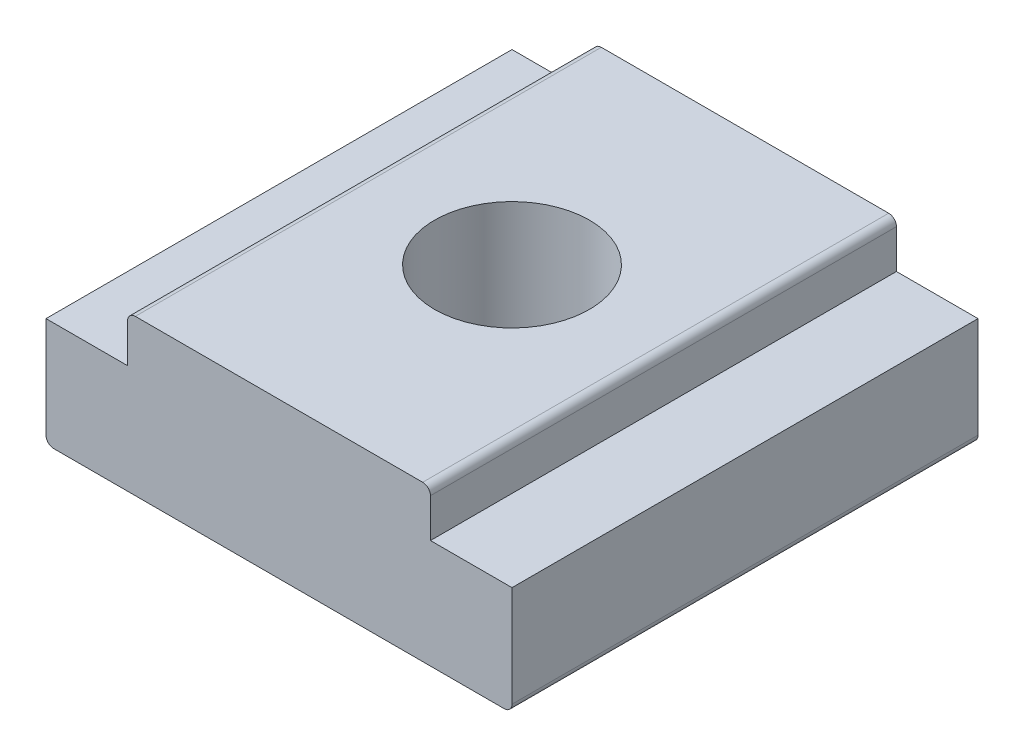
ISO-10303-21;
HEADER;
FILE_DESCRIPTION(('STEP AP214'),'2;1');
FILE_NAME('part.step','',(''),(''),'','','');
FILE_SCHEMA(('AUTOMOTIVE_DESIGN { 1 0 10303 214 1 1 1 1 }'));
ENDSEC;
DATA;
#1=APPLICATION_CONTEXT('core data for automotive mechanical design processes');
#2=APPLICATION_PROTOCOL_DEFINITION('international standard','automotive_design',2000,#1);
#3=PRODUCT_CONTEXT('',#1,'mechanical');
#4=PRODUCT('Part','Part','',(#3));
#5=PRODUCT_RELATED_PRODUCT_CATEGORY('part','',(#4));
#6=PRODUCT_DEFINITION_FORMATION('','',#4);
#7=PRODUCT_DEFINITION_CONTEXT('part definition',#1,'design');
#8=PRODUCT_DEFINITION('design','',#6,#7);
#9=PRODUCT_DEFINITION_SHAPE('','',#8);
#10=(LENGTH_UNIT() NAMED_UNIT(*) SI_UNIT(.MILLI.,.METRE.));
#11=(NAMED_UNIT(*) PLANE_ANGLE_UNIT() SI_UNIT($,.RADIAN.));
#12=(NAMED_UNIT(*) SI_UNIT($,.STERADIAN.) SOLID_ANGLE_UNIT());
#13=UNCERTAINTY_MEASURE_WITH_UNIT(LENGTH_MEASURE(1.E-05),#10,'distance_accuracy_value','');
#14=(GEOMETRIC_REPRESENTATION_CONTEXT(3) GLOBAL_UNCERTAINTY_ASSIGNED_CONTEXT((#13)) GLOBAL_UNIT_ASSIGNED_CONTEXT((#10,
#11,#12)) REPRESENTATION_CONTEXT('',''));
#15=CARTESIAN_POINT('',(0.,0.,0.));
#16=DIRECTION('',(0.,0.,1.));
#17=DIRECTION('',(1.,0.,0.));
#18=AXIS2_PLACEMENT_3D('',#15,#16,#17);
#19=CARTESIAN_POINT('',(-23.8125,0.,23.8125));
#20=DIRECTION('',(0.,1.,0.));
#21=DIRECTION('',(0.,0.,1.));
#22=AXIS2_PLACEMENT_3D('',#19,#20,#21);
#23=PLANE('',#22);
#24=CARTESIAN_POINT('',(0.,0.,0.));
#25=DIRECTION('',(0.,1.,0.));
#26=DIRECTION('',(0.,0.,1.));
#27=AXIS2_PLACEMENT_3D('',#24,#25,#26);
#28=CIRCLE('',#27,7.9121);
#29=CARTESIAN_POINT('',(0.,0.,7.9121));
#30=VERTEX_POINT('',#29);
#31=EDGE_CURVE('E166',#30,#30,#28,.T.);
#32=ORIENTED_EDGE('',*,*,#31,.T.);
#33=EDGE_LOOP('',(#32));
#34=FACE_BOUND('',#33,.T.);
#35=DIRECTION('',(1.,0.,0.));
#36=VECTOR('',#35,1.);
#37=CARTESIAN_POINT('',(-23.8125,0.,23.8125));
#38=LINE('',#37,#36);
#39=CARTESIAN_POINT('',(-23.01875,0.,23.8125));
#40=VERTEX_POINT('',#39);
#41=CARTESIAN_POINT('',(23.01875,0.,23.8125));
#42=VERTEX_POINT('',#41);
#43=EDGE_CURVE('E134',#40,#42,#38,.T.);
#44=ORIENTED_EDGE('',*,*,#43,.F.);
#45=DIRECTION('',(0.,0.,-1.));
#46=VECTOR('',#45,1.);
#47=CARTESIAN_POINT('',(-23.01875,0.,23.8125));
#48=LINE('',#47,#46);
#49=CARTESIAN_POINT('',(-23.01875,0.,-23.8125));
#50=VERTEX_POINT('',#49);
#51=EDGE_CURVE('E189',#40,#50,#48,.T.);
#52=ORIENTED_EDGE('',*,*,#51,.T.);
#53=DIRECTION('',(1.,0.,0.));
#54=VECTOR('',#53,1.);
#55=CARTESIAN_POINT('',(-23.8125,0.,-23.8125));
#56=LINE('',#55,#54);
#57=CARTESIAN_POINT('',(23.01875,0.,-23.8125));
#58=VERTEX_POINT('',#57);
#59=EDGE_CURVE('E163',#50,#58,#56,.T.);
#60=ORIENTED_EDGE('',*,*,#59,.T.);
#61=DIRECTION('',(0.,0.,-1.));
#62=VECTOR('',#61,1.);
#63=CARTESIAN_POINT('',(23.01875,0.,23.8125));
#64=LINE('',#63,#62);
#65=EDGE_CURVE('E143',#58,#42,#64,.F.);
#66=ORIENTED_EDGE('',*,*,#65,.T.);
#67=EDGE_LOOP('',(#44,#52,#60,#66));
#68=FACE_BOUND('',#67,.T.);
#69=ADVANCED_FACE('F33',(#34,#68),#23,.F.);
#70=CARTESIAN_POINT('',(23.8125,11.1125,23.8125));
#71=DIRECTION('',(-1.,0.,0.));
#72=DIRECTION('',(0.,0.,1.));
#73=AXIS2_PLACEMENT_3D('',#70,#71,#72);
#74=PLANE('',#73);
#75=DIRECTION('',(0.,1.,0.));
#76=VECTOR('',#75,1.);
#77=CARTESIAN_POINT('',(23.8125,11.1125,23.8125));
#78=LINE('',#77,#76);
#79=CARTESIAN_POINT('',(23.8125,0.793749999999999,23.8125));
#80=VERTEX_POINT('',#79);
#81=CARTESIAN_POINT('',(23.8125,11.1125,23.8125));
#82=VERTEX_POINT('',#81);
#83=EDGE_CURVE('E120',#80,#82,#78,.T.);
#84=ORIENTED_EDGE('',*,*,#83,.F.);
#85=DIRECTION('',(0.,0.,-1.));
#86=VECTOR('',#85,1.);
#87=CARTESIAN_POINT('',(23.8125,0.793749999999999,23.8125));
#88=LINE('',#87,#86);
#89=CARTESIAN_POINT('',(23.8125,0.793749999999999,-23.8125));
#90=VERTEX_POINT('',#89);
#91=EDGE_CURVE('E208',#80,#90,#88,.T.);
#92=ORIENTED_EDGE('',*,*,#91,.T.);
#93=DIRECTION('',(0.,1.,0.));
#94=VECTOR('',#93,1.);
#95=CARTESIAN_POINT('',(23.8125,11.1125,-23.8125));
#96=LINE('',#95,#94);
#97=CARTESIAN_POINT('',(23.8125,11.1125,-23.8125));
#98=VERTEX_POINT('',#97);
#99=EDGE_CURVE('E140',#90,#98,#96,.T.);
#100=ORIENTED_EDGE('',*,*,#99,.T.);
#101=DIRECTION('',(0.,0.,-1.));
#102=VECTOR('',#101,1.);
#103=CARTESIAN_POINT('',(23.8125,11.1125,23.8125));
#104=LINE('',#103,#102);
#105=EDGE_CURVE('E137',#82,#98,#104,.T.);
#106=ORIENTED_EDGE('',*,*,#105,.F.);
#107=EDGE_LOOP('',(#84,#92,#100,#106));
#108=FACE_BOUND('',#107,.T.);
#109=ADVANCED_FACE('F138',(#108),#74,.F.);
#110=CARTESIAN_POINT('',(15.478125,11.1125,23.8125));
#111=DIRECTION('',(0.,-1.,0.));
#112=DIRECTION('',(0.,0.,-1.));
#113=AXIS2_PLACEMENT_3D('',#110,#111,#112);
#114=PLANE('',#113);
#115=DIRECTION('',(-1.,0.,0.));
#116=VECTOR('',#115,1.);
#117=CARTESIAN_POINT('',(15.478125,11.1125,-23.8125));
#118=LINE('',#117,#116);
#119=CARTESIAN_POINT('',(15.478125,11.1125,-23.8125));
#120=VERTEX_POINT('',#119);
#121=EDGE_CURVE('E168',#98,#120,#118,.T.);
#122=ORIENTED_EDGE('',*,*,#121,.T.);
#123=DIRECTION('',(0.,0.,-1.));
#124=VECTOR('',#123,1.);
#125=CARTESIAN_POINT('',(15.478125,11.1125,23.8125));
#126=LINE('',#125,#124);
#127=CARTESIAN_POINT('',(15.478125,11.1125,23.8125));
#128=VERTEX_POINT('',#127);
#129=EDGE_CURVE('E144',#128,#120,#126,.T.);
#130=ORIENTED_EDGE('',*,*,#129,.F.);
#131=DIRECTION('',(-1.,0.,0.));
#132=VECTOR('',#131,1.);
#133=CARTESIAN_POINT('',(15.478125,11.1125,23.8125));
#134=LINE('',#133,#132);
#135=EDGE_CURVE('E126',#82,#128,#134,.T.);
#136=ORIENTED_EDGE('',*,*,#135,.F.);
#137=ORIENTED_EDGE('',*,*,#105,.T.);
#138=EDGE_LOOP('',(#122,#130,#136,#137));
#139=FACE_BOUND('',#138,.T.);
#140=ADVANCED_FACE('F146',(#139),#114,.F.);
#141=CARTESIAN_POINT('',(15.478125,15.875,23.8125));
#142=DIRECTION('',(-1.,0.,0.));
#143=DIRECTION('',(0.,0.,1.));
#144=AXIS2_PLACEMENT_3D('',#141,#142,#143);
#145=PLANE('',#144);
#146=DIRECTION('',(0.,1.,0.));
#147=VECTOR('',#146,1.);
#148=CARTESIAN_POINT('',(15.478125,15.875,-23.8125));
#149=LINE('',#148,#147);
#150=CARTESIAN_POINT('',(15.478125,15.08125,-23.8125));
#151=VERTEX_POINT('',#150);
#152=EDGE_CURVE('E170',#120,#151,#149,.T.);
#153=ORIENTED_EDGE('',*,*,#152,.T.);
#154=DIRECTION('',(0.,0.,-1.));
#155=VECTOR('',#154,1.);
#156=CARTESIAN_POINT('',(15.478125,15.08125,23.8125));
#157=LINE('',#156,#155);
#158=CARTESIAN_POINT('',(15.478125,15.08125,23.8125));
#159=VERTEX_POINT('',#158);
#160=EDGE_CURVE('E11',#151,#159,#157,.F.);
#161=ORIENTED_EDGE('',*,*,#160,.T.);
#162=DIRECTION('',(0.,1.,0.));
#163=VECTOR('',#162,1.);
#164=CARTESIAN_POINT('',(15.478125,15.875,23.8125));
#165=LINE('',#164,#163);
#166=EDGE_CURVE('E149',#128,#159,#165,.T.);
#167=ORIENTED_EDGE('',*,*,#166,.F.);
#168=ORIENTED_EDGE('',*,*,#129,.T.);
#169=EDGE_LOOP('',(#153,#161,#167,#168));
#170=FACE_BOUND('',#169,.T.);
#171=ADVANCED_FACE('F263',(#170),#145,.F.);
#172=CARTESIAN_POINT('',(15.478125,15.875,23.8125));
#173=DIRECTION('',(0.,-1.,0.));
#174=DIRECTION('',(0.,0.,-1.));
#175=AXIS2_PLACEMENT_3D('',#172,#173,#174);
#176=PLANE('',#175);
#177=CARTESIAN_POINT('',(0.,15.875,0.));
#178=DIRECTION('',(0.,1.,0.));
#179=DIRECTION('',(0.,0.,1.));
#180=AXIS2_PLACEMENT_3D('',#177,#178,#179);
#181=CIRCLE('',#180,7.9121);
#182=CARTESIAN_POINT('',(0.,15.875,7.9121));
#183=VERTEX_POINT('',#182);
#184=EDGE_CURVE('E249',#183,#183,#181,.T.);
#185=ORIENTED_EDGE('',*,*,#184,.F.);
#186=EDGE_LOOP('',(#185));
#187=FACE_BOUND('',#186,.T.);
#188=DIRECTION('',(-1.,0.,0.));
#189=VECTOR('',#188,1.);
#190=CARTESIAN_POINT('',(15.478125,15.875,-23.8125));
#191=LINE('',#190,#189);
#192=CARTESIAN_POINT('',(14.684375,15.875,-23.8125));
#193=VERTEX_POINT('',#192);
#194=CARTESIAN_POINT('',(-14.684375,15.875,-23.8125));
#195=VERTEX_POINT('',#194);
#196=EDGE_CURVE('E173',#193,#195,#191,.T.);
#197=ORIENTED_EDGE('',*,*,#196,.T.);
#198=DIRECTION('',(0.,0.,-1.));
#199=VECTOR('',#198,1.);
#200=CARTESIAN_POINT('',(-14.684375,15.875,23.8125));
#201=LINE('',#200,#199);
#202=CARTESIAN_POINT('',(-14.684375,15.875,23.8125));
#203=VERTEX_POINT('',#202);
#204=EDGE_CURVE('E41',#195,#203,#201,.F.);
#205=ORIENTED_EDGE('',*,*,#204,.T.);
#206=DIRECTION('',(-1.,0.,0.));
#207=VECTOR('',#206,1.);
#208=CARTESIAN_POINT('',(15.478125,15.875,23.8125));
#209=LINE('',#208,#207);
#210=CARTESIAN_POINT('',(14.684375,15.875,23.8125));
#211=VERTEX_POINT('',#210);
#212=EDGE_CURVE('E151',#211,#203,#209,.T.);
#213=ORIENTED_EDGE('',*,*,#212,.F.);
#214=DIRECTION('',(0.,0.,-1.));
#215=VECTOR('',#214,1.);
#216=CARTESIAN_POINT('',(14.684375,15.875,23.8125));
#217=LINE('',#216,#215);
#218=EDGE_CURVE('E213',#211,#193,#217,.T.);
#219=ORIENTED_EDGE('',*,*,#218,.T.);
#220=EDGE_LOOP('',(#197,#205,#213,#219));
#221=FACE_BOUND('',#220,.T.);
#222=ADVANCED_FACE('F217',(#187,#221),#176,.F.);
#223=CARTESIAN_POINT('',(-15.478125,15.875,23.8125));
#224=DIRECTION('',(1.,0.,0.));
#225=DIRECTION('',(0.,0.,-1.));
#226=AXIS2_PLACEMENT_3D('',#223,#224,#225);
#227=PLANE('',#226);
#228=DIRECTION('',(0.,-1.,0.));
#229=VECTOR('',#228,1.);
#230=CARTESIAN_POINT('',(-15.478125,15.875,23.8125));
#231=LINE('',#230,#229);
#232=CARTESIAN_POINT('',(-15.478125,15.08125,23.8125));
#233=VERTEX_POINT('',#232);
#234=CARTESIAN_POINT('',(-15.478125,11.1125,23.8125));
#235=VERTEX_POINT('',#234);
#236=EDGE_CURVE('E156',#233,#235,#231,.T.);
#237=ORIENTED_EDGE('',*,*,#236,.F.);
#238=DIRECTION('',(0.,0.,-1.));
#239=VECTOR('',#238,1.);
#240=CARTESIAN_POINT('',(-15.478125,15.08125,23.8125));
#241=LINE('',#240,#239);
#242=CARTESIAN_POINT('',(-15.478125,15.08125,-23.8125));
#243=VERTEX_POINT('',#242);
#244=EDGE_CURVE('E210',#233,#243,#241,.T.);
#245=ORIENTED_EDGE('',*,*,#244,.T.);
#246=DIRECTION('',(0.,-1.,0.));
#247=VECTOR('',#246,1.);
#248=CARTESIAN_POINT('',(-15.478125,15.875,-23.8125));
#249=LINE('',#248,#247);
#250=CARTESIAN_POINT('',(-15.478125,11.1125,-23.8125));
#251=VERTEX_POINT('',#250);
#252=EDGE_CURVE('E175',#243,#251,#249,.T.);
#253=ORIENTED_EDGE('',*,*,#252,.T.);
#254=DIRECTION('',(0.,0.,-1.));
#255=VECTOR('',#254,1.);
#256=CARTESIAN_POINT('',(-15.478125,11.1125,23.8125));
#257=LINE('',#256,#255);
#258=EDGE_CURVE('E184',#235,#251,#257,.T.);
#259=ORIENTED_EDGE('',*,*,#258,.F.);
#260=EDGE_LOOP('',(#237,#245,#253,#259));
#261=FACE_BOUND('',#260,.T.);
#262=ADVANCED_FACE('F230',(#261),#227,.F.);
#263=CARTESIAN_POINT('',(-15.478125,11.1125,23.8125));
#264=DIRECTION('',(0.,-1.,0.));
#265=DIRECTION('',(0.,0.,-1.));
#266=AXIS2_PLACEMENT_3D('',#263,#264,#265);
#267=PLANE('',#266);
#268=DIRECTION('',(-1.,0.,0.));
#269=VECTOR('',#268,1.);
#270=CARTESIAN_POINT('',(-15.478125,11.1125,-23.8125));
#271=LINE('',#270,#269);
#272=CARTESIAN_POINT('',(-23.8125,11.1125,-23.8125));
#273=VERTEX_POINT('',#272);
#274=EDGE_CURVE('E177',#251,#273,#271,.T.);
#275=ORIENTED_EDGE('',*,*,#274,.T.);
#276=DIRECTION('',(0.,0.,-1.));
#277=VECTOR('',#276,1.);
#278=CARTESIAN_POINT('',(-23.8125,11.1125,23.8125));
#279=LINE('',#278,#277);
#280=CARTESIAN_POINT('',(-23.8125,11.1125,23.8125));
#281=VERTEX_POINT('',#280);
#282=EDGE_CURVE('E162',#281,#273,#279,.T.);
#283=ORIENTED_EDGE('',*,*,#282,.F.);
#284=DIRECTION('',(-1.,0.,0.));
#285=VECTOR('',#284,1.);
#286=CARTESIAN_POINT('',(-15.478125,11.1125,23.8125));
#287=LINE('',#286,#285);
#288=EDGE_CURVE('E158',#235,#281,#287,.T.);
#289=ORIENTED_EDGE('',*,*,#288,.F.);
#290=ORIENTED_EDGE('',*,*,#258,.T.);
#291=EDGE_LOOP('',(#275,#283,#289,#290));
#292=FACE_BOUND('',#291,.T.);
#293=ADVANCED_FACE('F237',(#292),#267,.F.);
#294=CARTESIAN_POINT('',(-23.8125,11.1125,23.8125));
#295=DIRECTION('',(1.,0.,0.));
#296=DIRECTION('',(0.,0.,-1.));
#297=AXIS2_PLACEMENT_3D('',#294,#295,#296);
#298=PLANE('',#297);
#299=DIRECTION('',(0.,-1.,0.));
#300=VECTOR('',#299,1.);
#301=CARTESIAN_POINT('',(-23.8125,11.1125,-23.8125));
#302=LINE('',#301,#300);
#303=CARTESIAN_POINT('',(-23.8125,0.793749999999999,-23.8125));
#304=VERTEX_POINT('',#303);
#305=EDGE_CURVE('E179',#273,#304,#302,.T.);
#306=ORIENTED_EDGE('',*,*,#305,.T.);
#307=DIRECTION('',(0.,0.,-1.));
#308=VECTOR('',#307,1.);
#309=CARTESIAN_POINT('',(-23.8125,0.793749999999999,23.8125));
#310=LINE('',#309,#308);
#311=CARTESIAN_POINT('',(-23.8125,0.793749999999999,23.8125));
#312=VERTEX_POINT('',#311);
#313=EDGE_CURVE('E200',#304,#312,#310,.F.);
#314=ORIENTED_EDGE('',*,*,#313,.T.);
#315=DIRECTION('',(0.,-1.,0.));
#316=VECTOR('',#315,1.);
#317=CARTESIAN_POINT('',(-23.8125,11.1125,23.8125));
#318=LINE('',#317,#316);
#319=EDGE_CURVE('E160',#281,#312,#318,.T.);
#320=ORIENTED_EDGE('',*,*,#319,.F.);
#321=ORIENTED_EDGE('',*,*,#282,.T.);
#322=EDGE_LOOP('',(#306,#314,#320,#321));
#323=FACE_BOUND('',#322,.T.);
#324=ADVANCED_FACE('F240',(#323),#298,.F.);
#325=CARTESIAN_POINT('',(0.,0.,23.8125));
#326=DIRECTION('',(0.,0.,-1.));
#327=DIRECTION('',(-1.,0.,0.));
#328=AXIS2_PLACEMENT_3D('',#325,#326,#327);
#329=PLANE('',#328);
#330=ORIENTED_EDGE('',*,*,#319,.T.);
#331=CARTESIAN_POINT('',(-23.01875,0.79375,23.8125));
#332=DIRECTION('',(0.,0.,-1.));
#333=DIRECTION('',(-1.,0.,0.));
#334=AXIS2_PLACEMENT_3D('',#331,#332,#333);
#335=CIRCLE('',#334,0.79375);
#336=EDGE_CURVE('E206',#312,#40,#335,.F.);
#337=ORIENTED_EDGE('',*,*,#336,.T.);
#338=ORIENTED_EDGE('',*,*,#43,.T.);
#339=CARTESIAN_POINT('',(23.01875,0.793749999999999,23.8125));
#340=DIRECTION('',(0.,0.,-1.));
#341=DIRECTION('',(-1.,0.,0.));
#342=AXIS2_PLACEMENT_3D('',#339,#340,#341);
#343=CIRCLE('',#342,0.79375);
#344=EDGE_CURVE('E130',#42,#80,#343,.F.);
#345=ORIENTED_EDGE('',*,*,#344,.T.);
#346=ORIENTED_EDGE('',*,*,#83,.T.);
#347=ORIENTED_EDGE('',*,*,#135,.T.);
#348=ORIENTED_EDGE('',*,*,#166,.T.);
#349=CARTESIAN_POINT('',(14.684375,15.08125,23.8125));
#350=DIRECTION('',(0.,0.,-1.));
#351=DIRECTION('',(-1.,0.,0.));
#352=AXIS2_PLACEMENT_3D('',#349,#350,#351);
#353=CIRCLE('',#352,0.79375);
#354=EDGE_CURVE('E202',#159,#211,#353,.F.);
#355=ORIENTED_EDGE('',*,*,#354,.T.);
#356=ORIENTED_EDGE('',*,*,#212,.T.);
#357=CARTESIAN_POINT('',(-14.684375,15.08125,23.8125));
#358=DIRECTION('',(0.,0.,-1.));
#359=DIRECTION('',(-1.,0.,0.));
#360=AXIS2_PLACEMENT_3D('',#357,#358,#359);
#361=CIRCLE('',#360,0.79375);
#362=EDGE_CURVE('E48',#203,#233,#361,.F.);
#363=ORIENTED_EDGE('',*,*,#362,.T.);
#364=ORIENTED_EDGE('',*,*,#236,.T.);
#365=ORIENTED_EDGE('',*,*,#288,.T.);
#366=EDGE_LOOP('',(#330,#337,#338,#345,#346,#347,#348,#355,#356,#363,#364,#365));
#367=FACE_BOUND('',#366,.T.);
#368=ADVANCED_FACE('F123',(#367),#329,.F.);
#369=CARTESIAN_POINT('',(0.,0.,-23.8125));
#370=DIRECTION('',(0.,0.,-1.));
#371=DIRECTION('',(-1.,0.,0.));
#372=AXIS2_PLACEMENT_3D('',#369,#370,#371);
#373=PLANE('',#372);
#374=ORIENTED_EDGE('',*,*,#59,.F.);
#375=CARTESIAN_POINT('',(-23.01875,0.79375,-23.8125));
#376=DIRECTION('',(0.,0.,-1.));
#377=DIRECTION('',(-1.,0.,0.));
#378=AXIS2_PLACEMENT_3D('',#375,#376,#377);
#379=CIRCLE('',#378,0.79375);
#380=EDGE_CURVE('E198',#50,#304,#379,.T.);
#381=ORIENTED_EDGE('',*,*,#380,.T.);
#382=ORIENTED_EDGE('',*,*,#305,.F.);
#383=ORIENTED_EDGE('',*,*,#274,.F.);
#384=ORIENTED_EDGE('',*,*,#252,.F.);
#385=CARTESIAN_POINT('',(-14.684375,15.08125,-23.8125));
#386=DIRECTION('',(0.,0.,-1.));
#387=DIRECTION('',(-1.,0.,0.));
#388=AXIS2_PLACEMENT_3D('',#385,#386,#387);
#389=CIRCLE('',#388,0.79375);
#390=EDGE_CURVE('E194',#243,#195,#389,.T.);
#391=ORIENTED_EDGE('',*,*,#390,.T.);
#392=ORIENTED_EDGE('',*,*,#196,.F.);
#393=CARTESIAN_POINT('',(14.684375,15.08125,-23.8125));
#394=DIRECTION('',(0.,0.,-1.));
#395=DIRECTION('',(-1.,0.,0.));
#396=AXIS2_PLACEMENT_3D('',#393,#394,#395);
#397=CIRCLE('',#396,0.79375);
#398=EDGE_CURVE('E192',#193,#151,#397,.T.);
#399=ORIENTED_EDGE('',*,*,#398,.T.);
#400=ORIENTED_EDGE('',*,*,#152,.F.);
#401=ORIENTED_EDGE('',*,*,#121,.F.);
#402=ORIENTED_EDGE('',*,*,#99,.F.);
#403=CARTESIAN_POINT('',(23.01875,0.793749999999999,-23.8125));
#404=DIRECTION('',(0.,0.,-1.));
#405=DIRECTION('',(-1.,0.,0.));
#406=AXIS2_PLACEMENT_3D('',#403,#404,#405);
#407=CIRCLE('',#406,0.79375);
#408=EDGE_CURVE('E196',#90,#58,#407,.T.);
#409=ORIENTED_EDGE('',*,*,#408,.T.);
#410=EDGE_LOOP('',(#374,#381,#382,#383,#384,#391,#392,#399,#400,#401,#402,#409));
#411=FACE_BOUND('',#410,.T.);
#412=ADVANCED_FACE('F222',(#411),#373,.T.);
#413=CARTESIAN_POINT('',(0.,0.,0.));
#414=DIRECTION('',(0.,1.,0.));
#415=DIRECTION('',(0.,0.,1.));
#416=AXIS2_PLACEMENT_3D('',#413,#414,#415);
#417=CYLINDRICAL_SURFACE('',#416,7.9121);
#418=ORIENTED_EDGE('',*,*,#31,.F.);
#419=EDGE_LOOP('',(#418));
#420=FACE_BOUND('',#419,.T.);
#421=ORIENTED_EDGE('',*,*,#184,.T.);
#422=EDGE_LOOP('',(#421));
#423=FACE_BOUND('',#422,.T.);
#424=ADVANCED_FACE('F256',(#420,#423),#417,.F.);
#425=CARTESIAN_POINT('',(-23.01875,0.79375,23.8125));
#426=DIRECTION('',(0.,0.,-1.));
#427=DIRECTION('',(-1.,0.,0.));
#428=AXIS2_PLACEMENT_3D('',#425,#426,#427);
#429=CYLINDRICAL_SURFACE('',#428,0.79375);
#430=ORIENTED_EDGE('',*,*,#336,.F.);
#431=ORIENTED_EDGE('',*,*,#313,.F.);
#432=ORIENTED_EDGE('',*,*,#380,.F.);
#433=ORIENTED_EDGE('',*,*,#51,.F.);
#434=EDGE_LOOP('',(#430,#431,#432,#433));
#435=FACE_BOUND('',#434,.T.);
#436=ADVANCED_FACE('F243',(#435),#429,.T.);
#437=CARTESIAN_POINT('',(23.01875,0.793749999999999,23.8125));
#438=DIRECTION('',(0.,0.,-1.));
#439=DIRECTION('',(-1.,0.,0.));
#440=AXIS2_PLACEMENT_3D('',#437,#438,#439);
#441=CYLINDRICAL_SURFACE('',#440,0.79375);
#442=ORIENTED_EDGE('',*,*,#344,.F.);
#443=ORIENTED_EDGE('',*,*,#65,.F.);
#444=ORIENTED_EDGE('',*,*,#408,.F.);
#445=ORIENTED_EDGE('',*,*,#91,.F.);
#446=EDGE_LOOP('',(#442,#443,#444,#445));
#447=FACE_BOUND('',#446,.T.);
#448=ADVANCED_FACE('F283',(#447),#441,.T.);
#449=CARTESIAN_POINT('',(-14.684375,15.08125,23.8125));
#450=DIRECTION('',(0.,0.,-1.));
#451=DIRECTION('',(-1.,0.,0.));
#452=AXIS2_PLACEMENT_3D('',#449,#450,#451);
#453=CYLINDRICAL_SURFACE('',#452,0.79375);
#454=ORIENTED_EDGE('',*,*,#362,.F.);
#455=ORIENTED_EDGE('',*,*,#204,.F.);
#456=ORIENTED_EDGE('',*,*,#390,.F.);
#457=ORIENTED_EDGE('',*,*,#244,.F.);
#458=EDGE_LOOP('',(#454,#455,#456,#457));
#459=FACE_BOUND('',#458,.T.);
#460=ADVANCED_FACE('F228',(#459),#453,.T.);
#461=CARTESIAN_POINT('',(14.684375,15.08125,23.8125));
#462=DIRECTION('',(0.,0.,-1.));
#463=DIRECTION('',(-1.,0.,0.));
#464=AXIS2_PLACEMENT_3D('',#461,#462,#463);
#465=CYLINDRICAL_SURFACE('',#464,0.79375);
#466=ORIENTED_EDGE('',*,*,#354,.F.);
#467=ORIENTED_EDGE('',*,*,#160,.F.);
#468=ORIENTED_EDGE('',*,*,#398,.F.);
#469=ORIENTED_EDGE('',*,*,#218,.F.);
#470=EDGE_LOOP('',(#466,#467,#468,#469));
#471=FACE_BOUND('',#470,.T.);
#472=ADVANCED_FACE('F35',(#471),#465,.T.);
#473=CLOSED_SHELL('',(#69,#109,#140,#171,#222,#262,#293,#324,#368,#412,#424,#436,#448,#460,#472));
#474=MANIFOLD_SOLID_BREP('B2',#473);
#475=ADVANCED_BREP_SHAPE_REPRESENTATION('',(#18,#474),#14);
#476=SHAPE_DEFINITION_REPRESENTATION(#9,#475);
ENDSEC;
END-ISO-10303-21;
